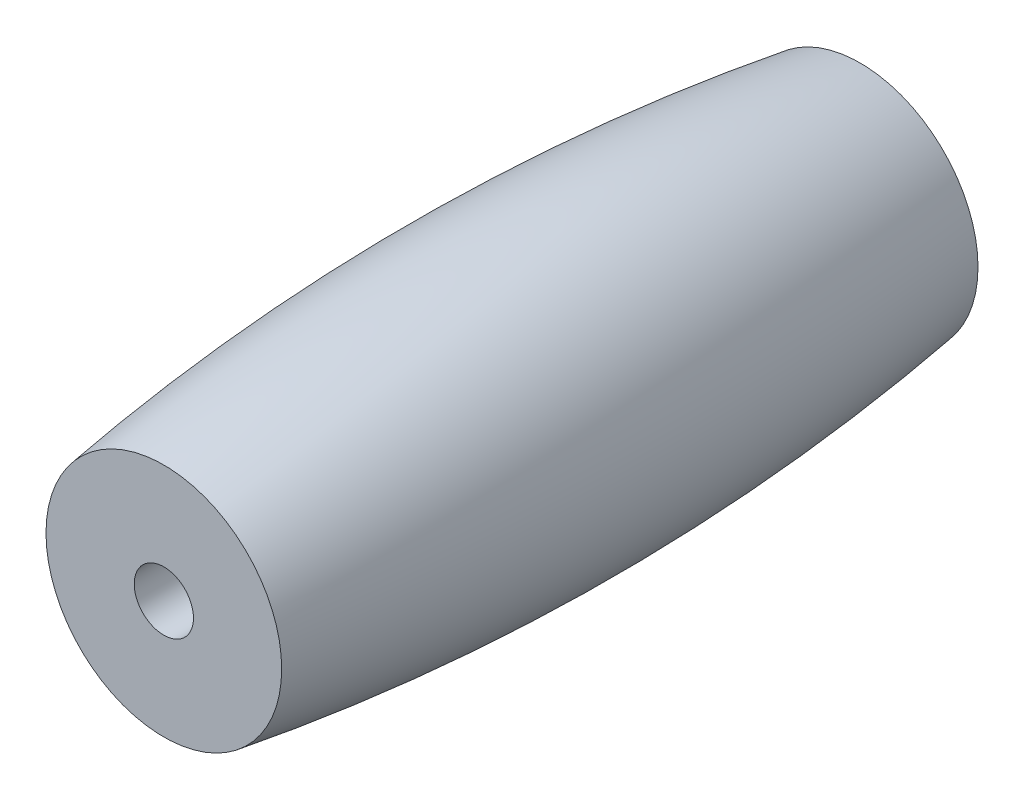
ISO-10303-21;
HEADER;
FILE_DESCRIPTION(('STEP AP214'),'2;1');
FILE_NAME('part.step','',(''),(''),'','','');
FILE_SCHEMA(('AUTOMOTIVE_DESIGN { 1 0 10303 214 1 1 1 1 }'));
ENDSEC;
DATA;
#1=APPLICATION_CONTEXT('core data for automotive mechanical design processes');
#2=APPLICATION_PROTOCOL_DEFINITION('international standard','automotive_design',2000,#1);
#3=PRODUCT_CONTEXT('',#1,'mechanical');
#4=PRODUCT('Part','Part','',(#3));
#5=PRODUCT_RELATED_PRODUCT_CATEGORY('part','',(#4));
#6=PRODUCT_DEFINITION_FORMATION('','',#4);
#7=PRODUCT_DEFINITION_CONTEXT('part definition',#1,'design');
#8=PRODUCT_DEFINITION('design','',#6,#7);
#9=PRODUCT_DEFINITION_SHAPE('','',#8);
#10=(LENGTH_UNIT() NAMED_UNIT(*) SI_UNIT(.MILLI.,.METRE.));
#11=(NAMED_UNIT(*) PLANE_ANGLE_UNIT() SI_UNIT($,.RADIAN.));
#12=(NAMED_UNIT(*) SI_UNIT($,.STERADIAN.) SOLID_ANGLE_UNIT());
#13=UNCERTAINTY_MEASURE_WITH_UNIT(LENGTH_MEASURE(1.E-05),#10,'distance_accuracy_value','');
#14=(GEOMETRIC_REPRESENTATION_CONTEXT(3) GLOBAL_UNCERTAINTY_ASSIGNED_CONTEXT((#13)) GLOBAL_UNIT_ASSIGNED_CONTEXT((#10,
#11,#12)) REPRESENTATION_CONTEXT('',''));
#15=CARTESIAN_POINT('',(0.,0.,0.));
#16=DIRECTION('',(0.,0.,1.));
#17=DIRECTION('',(1.,0.,0.));
#18=AXIS2_PLACEMENT_3D('',#15,#16,#17);
#19=CARTESIAN_POINT('',(0.,0.,0.));
#20=DIRECTION('',(0.,0.,-1.));
#21=DIRECTION('',(-1.,0.,0.));
#22=AXIS2_PLACEMENT_3D('',#19,#20,#21);
#23=DEGENERATE_TOROIDAL_SURFACE('',#22,147.070902529915,156.795902529915,.F.);
#24=CARTESIAN_POINT('',(0.,0.,23.5));
#25=DIRECTION('',(0.,0.,-1.));
#26=DIRECTION('',(-1.,0.,0.));
#27=AXIS2_PLACEMENT_3D('',#24,#25,#26);
#28=CIRCLE('',#27,7.95395047814498);
#29=CARTESIAN_POINT('',(-7.95395047814498,0.,23.5));
#30=VERTEX_POINT('',#29);
#31=EDGE_CURVE('E36',#30,#30,#28,.T.);
#32=ORIENTED_EDGE('',*,*,#31,.T.);
#33=EDGE_LOOP('',(#32));
#34=FACE_BOUND('',#33,.T.);
#35=CARTESIAN_POINT('',(0.,0.,-23.5));
#36=DIRECTION('',(0.,0.,-1.));
#37=DIRECTION('',(-1.,0.,0.));
#38=AXIS2_PLACEMENT_3D('',#35,#36,#37);
#39=CIRCLE('',#38,7.95395047814498);
#40=CARTESIAN_POINT('',(-7.95395047814498,0.,-23.5));
#41=VERTEX_POINT('',#40);
#42=EDGE_CURVE('E10',#41,#41,#39,.T.);
#43=ORIENTED_EDGE('',*,*,#42,.F.);
#44=EDGE_LOOP('',(#43));
#45=FACE_BOUND('',#44,.T.);
#46=ADVANCED_FACE('F30',(#34,#45),#23,.F.);
#47=CARTESIAN_POINT('',(0.,0.,-23.5));
#48=DIRECTION('',(0.,0.,-1.));
#49=DIRECTION('',(-1.,0.,0.));
#50=AXIS2_PLACEMENT_3D('',#47,#48,#49);
#51=PLANE('',#50);
#52=CARTESIAN_POINT('',(0.,0.,-23.5));
#53=DIRECTION('',(0.,0.,1.));
#54=DIRECTION('',(1.,0.,0.));
#55=AXIS2_PLACEMENT_3D('',#52,#53,#54);
#56=CIRCLE('',#55,2.);
#57=CARTESIAN_POINT('',(2.,0.,-23.5));
#58=VERTEX_POINT('',#57);
#59=EDGE_CURVE('E40',#58,#58,#56,.T.);
#60=ORIENTED_EDGE('',*,*,#59,.T.);
#61=EDGE_LOOP('',(#60));
#62=FACE_BOUND('',#61,.T.);
#63=ORIENTED_EDGE('',*,*,#42,.T.);
#64=EDGE_LOOP('',(#63));
#65=FACE_BOUND('',#64,.T.);
#66=ADVANCED_FACE('F55',(#62,#65),#51,.T.);
#67=CARTESIAN_POINT('',(0.,0.,23.5));
#68=DIRECTION('',(0.,0.,1.));
#69=DIRECTION('',(1.,0.,0.));
#70=AXIS2_PLACEMENT_3D('',#67,#68,#69);
#71=PLANE('',#70);
#72=CARTESIAN_POINT('',(0.,0.,23.5));
#73=DIRECTION('',(0.,0.,1.));
#74=DIRECTION('',(1.,0.,0.));
#75=AXIS2_PLACEMENT_3D('',#72,#73,#74);
#76=CIRCLE('',#75,2.);
#77=CARTESIAN_POINT('',(2.,0.,23.5));
#78=VERTEX_POINT('',#77);
#79=EDGE_CURVE('E44',#78,#78,#76,.T.);
#80=ORIENTED_EDGE('',*,*,#79,.F.);
#81=EDGE_LOOP('',(#80));
#82=FACE_BOUND('',#81,.T.);
#83=ORIENTED_EDGE('',*,*,#31,.F.);
#84=EDGE_LOOP('',(#83));
#85=FACE_BOUND('',#84,.T.);
#86=ADVANCED_FACE('F52',(#82,#85),#71,.T.);
#87=CARTESIAN_POINT('',(0.,0.,-23.5));
#88=DIRECTION('',(0.,0.,1.));
#89=DIRECTION('',(1.,0.,0.));
#90=AXIS2_PLACEMENT_3D('',#87,#88,#89);
#91=CYLINDRICAL_SURFACE('',#90,2.);
#92=ORIENTED_EDGE('',*,*,#59,.F.);
#93=EDGE_LOOP('',(#92));
#94=FACE_BOUND('',#93,.T.);
#95=ORIENTED_EDGE('',*,*,#79,.T.);
#96=EDGE_LOOP('',(#95));
#97=FACE_BOUND('',#96,.T.);
#98=ADVANCED_FACE('F50',(#94,#97),#91,.F.);
#99=CLOSED_SHELL('',(#46,#66,#86,#98));
#100=MANIFOLD_SOLID_BREP('B2',#99);
#101=ADVANCED_BREP_SHAPE_REPRESENTATION('',(#18,#100),#14);
#102=SHAPE_DEFINITION_REPRESENTATION(#9,#101);
ENDSEC;
END-ISO-10303-21;
